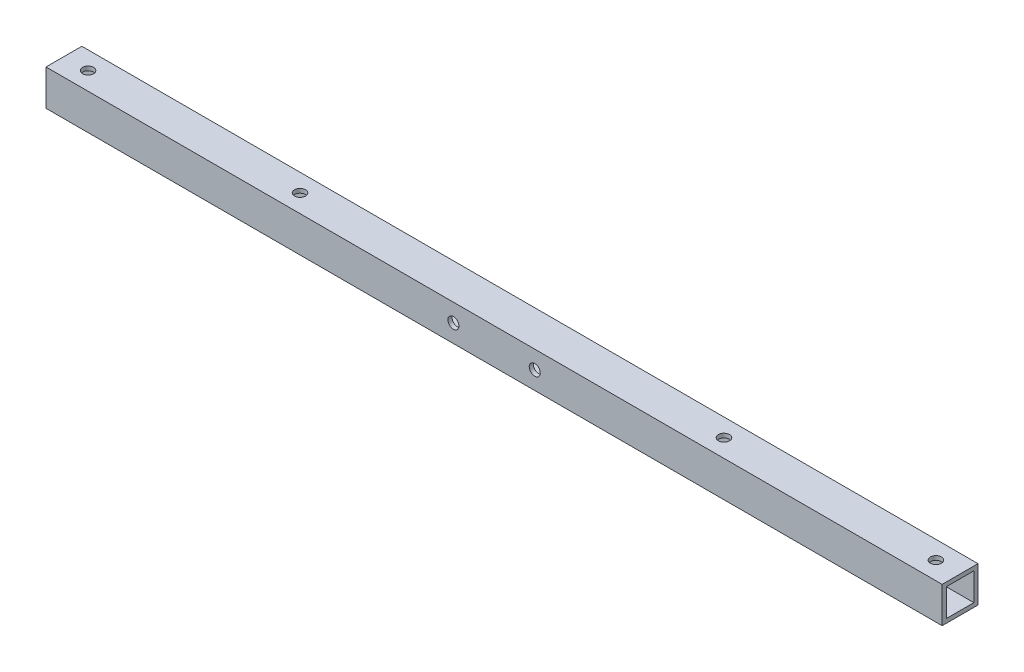
ISO-10303-21;
HEADER;
FILE_DESCRIPTION(('STEP AP214'),'2;1');
FILE_NAME('part.step','',(''),(''),'','','');
FILE_SCHEMA(('AUTOMOTIVE_DESIGN { 1 0 10303 214 1 1 1 1 }'));
ENDSEC;
DATA;
#1=APPLICATION_CONTEXT('core data for automotive mechanical design processes');
#2=APPLICATION_PROTOCOL_DEFINITION('international standard','automotive_design',2000,#1);
#3=PRODUCT_CONTEXT('',#1,'mechanical');
#4=PRODUCT('Part','Part','',(#3));
#5=PRODUCT_RELATED_PRODUCT_CATEGORY('part','',(#4));
#6=PRODUCT_DEFINITION_FORMATION('','',#4);
#7=PRODUCT_DEFINITION_CONTEXT('part definition',#1,'design');
#8=PRODUCT_DEFINITION('design','',#6,#7);
#9=PRODUCT_DEFINITION_SHAPE('','',#8);
#10=(LENGTH_UNIT() NAMED_UNIT(*) SI_UNIT(.MILLI.,.METRE.));
#11=(NAMED_UNIT(*) PLANE_ANGLE_UNIT() SI_UNIT($,.RADIAN.));
#12=(NAMED_UNIT(*) SI_UNIT($,.STERADIAN.) SOLID_ANGLE_UNIT());
#13=UNCERTAINTY_MEASURE_WITH_UNIT(LENGTH_MEASURE(1.E-05),#10,'distance_accuracy_value','');
#14=(GEOMETRIC_REPRESENTATION_CONTEXT(3) GLOBAL_UNCERTAINTY_ASSIGNED_CONTEXT((#13)) GLOBAL_UNIT_ASSIGNED_CONTEXT((#10,
#11,#12)) REPRESENTATION_CONTEXT('',''));
#15=CARTESIAN_POINT('',(0.,0.,0.));
#16=DIRECTION('',(0.,0.,1.));
#17=DIRECTION('',(1.,0.,0.));
#18=AXIS2_PLACEMENT_3D('',#15,#16,#17);
#19=CARTESIAN_POINT('',(325.,26.,-13.));
#20=DIRECTION('',(-1.,0.,0.));
#21=DIRECTION('',(0.,0.,1.));
#22=AXIS2_PLACEMENT_3D('',#19,#20,#21);
#23=PLANE('',#22);
#24=DIRECTION('',(0.,0.,-1.));
#25=VECTOR('',#24,1.);
#26=CARTESIAN_POINT('',(325.,0.,-13.));
#27=LINE('',#26,#25);
#28=CARTESIAN_POINT('',(325.,0.,13.));
#29=VERTEX_POINT('',#28);
#30=CARTESIAN_POINT('',(325.,0.,-13.));
#31=VERTEX_POINT('',#30);
#32=EDGE_CURVE('E148',#29,#31,#27,.T.);
#33=ORIENTED_EDGE('',*,*,#32,.T.);
#34=DIRECTION('',(0.,-1.,0.));
#35=VECTOR('',#34,1.);
#36=CARTESIAN_POINT('',(325.,26.,-13.));
#37=LINE('',#36,#35);
#38=CARTESIAN_POINT('',(325.,26.,-13.));
#39=VERTEX_POINT('',#38);
#40=EDGE_CURVE('E11',#39,#31,#37,.T.);
#41=ORIENTED_EDGE('',*,*,#40,.F.);
#42=DIRECTION('',(0.,0.,-1.));
#43=VECTOR('',#42,1.);
#44=CARTESIAN_POINT('',(325.,26.,-13.));
#45=LINE('',#44,#43);
#46=CARTESIAN_POINT('',(325.,26.,13.));
#47=VERTEX_POINT('',#46);
#48=EDGE_CURVE('E157',#47,#39,#45,.T.);
#49=ORIENTED_EDGE('',*,*,#48,.F.);
#50=DIRECTION('',(0.,-1.,0.));
#51=VECTOR('',#50,1.);
#52=CARTESIAN_POINT('',(325.,26.,13.));
#53=LINE('',#52,#51);
#54=EDGE_CURVE('E171',#47,#29,#53,.T.);
#55=ORIENTED_EDGE('',*,*,#54,.T.);
#56=EDGE_LOOP('',(#33,#41,#49,#55));
#57=FACE_BOUND('',#56,.T.);
#58=DIRECTION('',(0.,0.,-1.));
#59=VECTOR('',#58,1.);
#60=CARTESIAN_POINT('',(325.,3.,-13.));
#61=LINE('',#60,#59);
#62=CARTESIAN_POINT('',(325.,3.,10.));
#63=VERTEX_POINT('',#62);
#64=CARTESIAN_POINT('',(325.,3.,-10.));
#65=VERTEX_POINT('',#64);
#66=EDGE_CURVE('E116',#63,#65,#61,.T.);
#67=ORIENTED_EDGE('',*,*,#66,.F.);
#68=DIRECTION('',(0.,-1.,0.));
#69=VECTOR('',#68,1.);
#70=CARTESIAN_POINT('',(325.,26.,10.));
#71=LINE('',#70,#69);
#72=CARTESIAN_POINT('',(325.,23.,10.));
#73=VERTEX_POINT('',#72);
#74=EDGE_CURVE('E142',#73,#63,#71,.T.);
#75=ORIENTED_EDGE('',*,*,#74,.F.);
#76=DIRECTION('',(0.,0.,-1.));
#77=VECTOR('',#76,1.);
#78=CARTESIAN_POINT('',(325.,23.,-13.));
#79=LINE('',#78,#77);
#80=CARTESIAN_POINT('',(325.,23.,-10.));
#81=VERTEX_POINT('',#80);
#82=EDGE_CURVE('E60',#73,#81,#79,.T.);
#83=ORIENTED_EDGE('',*,*,#82,.T.);
#84=DIRECTION('',(0.,-1.,0.));
#85=VECTOR('',#84,1.);
#86=CARTESIAN_POINT('',(325.,26.,-10.));
#87=LINE('',#86,#85);
#88=EDGE_CURVE('E128',#81,#65,#87,.T.);
#89=ORIENTED_EDGE('',*,*,#88,.T.);
#90=EDGE_LOOP('',(#67,#75,#83,#89));
#91=FACE_BOUND('',#90,.T.);
#92=ADVANCED_FACE('F43',(#57,#91),#23,.F.);
#93=CARTESIAN_POINT('',(-325.,26.,-13.));
#94=DIRECTION('',(1.,0.,0.));
#95=DIRECTION('',(0.,0.,-1.));
#96=AXIS2_PLACEMENT_3D('',#93,#94,#95);
#97=PLANE('',#96);
#98=DIRECTION('',(0.,0.,1.));
#99=VECTOR('',#98,1.);
#100=CARTESIAN_POINT('',(-325.,0.,-13.));
#101=LINE('',#100,#99);
#102=CARTESIAN_POINT('',(-325.,0.,-13.));
#103=VERTEX_POINT('',#102);
#104=CARTESIAN_POINT('',(-325.,0.,13.));
#105=VERTEX_POINT('',#104);
#106=EDGE_CURVE('E178',#103,#105,#101,.T.);
#107=ORIENTED_EDGE('',*,*,#106,.T.);
#108=DIRECTION('',(0.,-1.,0.));
#109=VECTOR('',#108,1.);
#110=CARTESIAN_POINT('',(-325.,26.,13.));
#111=LINE('',#110,#109);
#112=CARTESIAN_POINT('',(-325.,26.,13.));
#113=VERTEX_POINT('',#112);
#114=EDGE_CURVE('E186',#113,#105,#111,.T.);
#115=ORIENTED_EDGE('',*,*,#114,.F.);
#116=DIRECTION('',(0.,0.,1.));
#117=VECTOR('',#116,1.);
#118=CARTESIAN_POINT('',(-325.,26.,-13.));
#119=LINE('',#118,#117);
#120=CARTESIAN_POINT('',(-325.,26.,-13.));
#121=VERTEX_POINT('',#120);
#122=EDGE_CURVE('E165',#121,#113,#119,.T.);
#123=ORIENTED_EDGE('',*,*,#122,.F.);
#124=DIRECTION('',(0.,-1.,0.));
#125=VECTOR('',#124,1.);
#126=CARTESIAN_POINT('',(-325.,26.,-13.));
#127=LINE('',#126,#125);
#128=EDGE_CURVE('E52',#121,#103,#127,.T.);
#129=ORIENTED_EDGE('',*,*,#128,.T.);
#130=EDGE_LOOP('',(#107,#115,#123,#129));
#131=FACE_BOUND('',#130,.T.);
#132=DIRECTION('',(0.,0.,1.));
#133=VECTOR('',#132,1.);
#134=CARTESIAN_POINT('',(-325.,3.,-13.));
#135=LINE('',#134,#133);
#136=CARTESIAN_POINT('',(-325.,3.,-10.));
#137=VERTEX_POINT('',#136);
#138=CARTESIAN_POINT('',(-325.,3.,10.));
#139=VERTEX_POINT('',#138);
#140=EDGE_CURVE('E113',#137,#139,#135,.T.);
#141=ORIENTED_EDGE('',*,*,#140,.F.);
#142=DIRECTION('',(0.,-1.,0.));
#143=VECTOR('',#142,1.);
#144=CARTESIAN_POINT('',(-325.,26.,-10.));
#145=LINE('',#144,#143);
#146=CARTESIAN_POINT('',(-325.,23.,-10.));
#147=VERTEX_POINT('',#146);
#148=EDGE_CURVE('E123',#147,#137,#145,.T.);
#149=ORIENTED_EDGE('',*,*,#148,.F.);
#150=DIRECTION('',(0.,0.,1.));
#151=VECTOR('',#150,1.);
#152=CARTESIAN_POINT('',(-325.,23.,-13.));
#153=LINE('',#152,#151);
#154=CARTESIAN_POINT('',(-325.,23.,10.));
#155=VERTEX_POINT('',#154);
#156=EDGE_CURVE('E65',#147,#155,#153,.T.);
#157=ORIENTED_EDGE('',*,*,#156,.T.);
#158=DIRECTION('',(0.,-1.,0.));
#159=VECTOR('',#158,1.);
#160=CARTESIAN_POINT('',(-325.,26.,10.));
#161=LINE('',#160,#159);
#162=EDGE_CURVE('E129',#155,#139,#161,.T.);
#163=ORIENTED_EDGE('',*,*,#162,.T.);
#164=EDGE_LOOP('',(#141,#149,#157,#163));
#165=FACE_BOUND('',#164,.T.);
#166=ADVANCED_FACE('F132',(#131,#165),#97,.F.);
#167=CARTESIAN_POINT('',(-325.,26.,-13.));
#168=DIRECTION('',(0.,0.,1.));
#169=DIRECTION('',(1.,0.,0.));
#170=AXIS2_PLACEMENT_3D('',#167,#168,#169);
#171=PLANE('',#170);
#172=CARTESIAN_POINT('',(-29.4999999999988,13.,-13.));
#173=DIRECTION('',(0.,0.,1.));
#174=DIRECTION('',(1.,0.,0.));
#175=AXIS2_PLACEMENT_3D('',#172,#173,#174);
#176=CIRCLE('',#175,4.);
#177=CARTESIAN_POINT('',(-25.4999999999988,13.,-13.));
#178=VERTEX_POINT('',#177);
#179=EDGE_CURVE('E215',#178,#178,#176,.T.);
#180=ORIENTED_EDGE('',*,*,#179,.T.);
#181=EDGE_LOOP('',(#180));
#182=FACE_BOUND('',#181,.T.);
#183=CARTESIAN_POINT('',(29.5000000000012,12.9999999999999,-13.));
#184=DIRECTION('',(0.,0.,1.));
#185=DIRECTION('',(1.,0.,0.));
#186=AXIS2_PLACEMENT_3D('',#183,#184,#185);
#187=CIRCLE('',#186,4.);
#188=CARTESIAN_POINT('',(33.5000000000012,12.9999999999999,-13.));
#189=VERTEX_POINT('',#188);
#190=EDGE_CURVE('E230',#189,#189,#187,.T.);
#191=ORIENTED_EDGE('',*,*,#190,.T.);
#192=EDGE_LOOP('',(#191));
#193=FACE_BOUND('',#192,.T.);
#194=DIRECTION('',(-1.,0.,0.));
#195=VECTOR('',#194,1.);
#196=CARTESIAN_POINT('',(-325.,0.,-13.));
#197=LINE('',#196,#195);
#198=EDGE_CURVE('E175',#31,#103,#197,.T.);
#199=ORIENTED_EDGE('',*,*,#198,.T.);
#200=ORIENTED_EDGE('',*,*,#128,.F.);
#201=DIRECTION('',(-1.,0.,0.));
#202=VECTOR('',#201,1.);
#203=CARTESIAN_POINT('',(-325.,26.,-13.));
#204=LINE('',#203,#202);
#205=EDGE_CURVE('E161',#39,#121,#204,.T.);
#206=ORIENTED_EDGE('',*,*,#205,.F.);
#207=ORIENTED_EDGE('',*,*,#40,.T.);
#208=EDGE_LOOP('',(#199,#200,#206,#207));
#209=FACE_BOUND('',#208,.T.);
#210=ADVANCED_FACE('F298',(#182,#193,#209),#171,.F.);
#211=CARTESIAN_POINT('',(-325.,26.,13.));
#212=DIRECTION('',(0.,0.,-1.));
#213=DIRECTION('',(-1.,0.,0.));
#214=AXIS2_PLACEMENT_3D('',#211,#212,#213);
#215=PLANE('',#214);
#216=CARTESIAN_POINT('',(-29.4999999999988,13.,13.));
#217=DIRECTION('',(0.,0.,1.));
#218=DIRECTION('',(1.,0.,0.));
#219=AXIS2_PLACEMENT_3D('',#216,#217,#218);
#220=CIRCLE('',#219,4.);
#221=CARTESIAN_POINT('',(-25.4999999999988,13.,13.));
#222=VERTEX_POINT('',#221);
#223=EDGE_CURVE('E223',#222,#222,#220,.T.);
#224=ORIENTED_EDGE('',*,*,#223,.F.);
#225=EDGE_LOOP('',(#224));
#226=FACE_BOUND('',#225,.T.);
#227=CARTESIAN_POINT('',(29.5000000000012,12.9999999999999,13.));
#228=DIRECTION('',(0.,0.,1.));
#229=DIRECTION('',(1.,0.,0.));
#230=AXIS2_PLACEMENT_3D('',#227,#228,#229);
#231=CIRCLE('',#230,4.);
#232=CARTESIAN_POINT('',(33.5000000000012,12.9999999999999,13.));
#233=VERTEX_POINT('',#232);
#234=EDGE_CURVE('E236',#233,#233,#231,.T.);
#235=ORIENTED_EDGE('',*,*,#234,.F.);
#236=EDGE_LOOP('',(#235));
#237=FACE_BOUND('',#236,.T.);
#238=DIRECTION('',(1.,0.,0.));
#239=VECTOR('',#238,1.);
#240=CARTESIAN_POINT('',(-325.,0.,13.));
#241=LINE('',#240,#239);
#242=EDGE_CURVE('E162',#105,#29,#241,.T.);
#243=ORIENTED_EDGE('',*,*,#242,.T.);
#244=ORIENTED_EDGE('',*,*,#54,.F.);
#245=DIRECTION('',(1.,0.,0.));
#246=VECTOR('',#245,1.);
#247=CARTESIAN_POINT('',(-325.,26.,13.));
#248=LINE('',#247,#246);
#249=EDGE_CURVE('E168',#113,#47,#248,.T.);
#250=ORIENTED_EDGE('',*,*,#249,.F.);
#251=ORIENTED_EDGE('',*,*,#114,.T.);
#252=EDGE_LOOP('',(#243,#244,#250,#251));
#253=FACE_BOUND('',#252,.T.);
#254=ADVANCED_FACE('F317',(#226,#237,#253),#215,.F.);
#255=CARTESIAN_POINT('',(0.,26.,0.));
#256=DIRECTION('',(0.,1.,0.));
#257=DIRECTION('',(0.,0.,1.));
#258=AXIS2_PLACEMENT_3D('',#255,#256,#257);
#259=PLANE('',#258);
#260=CARTESIAN_POINT('',(307.5,26.,0.));
#261=DIRECTION('',(0.,1.,0.));
#262=DIRECTION('',(0.,0.,1.));
#263=AXIS2_PLACEMENT_3D('',#260,#261,#262);
#264=CIRCLE('',#263,3.99999999999999);
#265=CARTESIAN_POINT('',(307.5,26.,3.99999999999999));
#266=VERTEX_POINT('',#265);
#267=EDGE_CURVE('E248',#266,#266,#264,.T.);
#268=ORIENTED_EDGE('',*,*,#267,.F.);
#269=EDGE_LOOP('',(#268));
#270=FACE_BOUND('',#269,.T.);
#271=CARTESIAN_POINT('',(-153.75,26.,0.));
#272=DIRECTION('',(0.,1.,0.));
#273=DIRECTION('',(0.,0.,-1.));
#274=AXIS2_PLACEMENT_3D('',#271,#272,#273);
#275=CIRCLE('',#274,3.99999999999999);
#276=CARTESIAN_POINT('',(-153.75,26.,-3.99999999999998));
#277=VERTEX_POINT('',#276);
#278=EDGE_CURVE('E244',#277,#277,#275,.T.);
#279=ORIENTED_EDGE('',*,*,#278,.F.);
#280=EDGE_LOOP('',(#279));
#281=FACE_BOUND('',#280,.T.);
#282=CARTESIAN_POINT('',(153.75,26.,0.));
#283=DIRECTION('',(0.,1.,0.));
#284=DIRECTION('',(0.,0.,1.));
#285=AXIS2_PLACEMENT_3D('',#282,#283,#284);
#286=CIRCLE('',#285,3.99999999999999);
#287=CARTESIAN_POINT('',(153.75,26.,3.99999999999999));
#288=VERTEX_POINT('',#287);
#289=EDGE_CURVE('E257',#288,#288,#286,.T.);
#290=ORIENTED_EDGE('',*,*,#289,.F.);
#291=EDGE_LOOP('',(#290));
#292=FACE_BOUND('',#291,.T.);
#293=CARTESIAN_POINT('',(-307.5,26.,0.));
#294=DIRECTION('',(0.,1.,0.));
#295=DIRECTION('',(0.,0.,-1.));
#296=AXIS2_PLACEMENT_3D('',#293,#294,#295);
#297=CIRCLE('',#296,3.99999999999999);
#298=CARTESIAN_POINT('',(-307.5,26.,-3.99999999999999));
#299=VERTEX_POINT('',#298);
#300=EDGE_CURVE('E264',#299,#299,#297,.T.);
#301=ORIENTED_EDGE('',*,*,#300,.F.);
#302=EDGE_LOOP('',(#301));
#303=FACE_BOUND('',#302,.T.);
#304=ORIENTED_EDGE('',*,*,#48,.T.);
#305=ORIENTED_EDGE('',*,*,#205,.T.);
#306=ORIENTED_EDGE('',*,*,#122,.T.);
#307=ORIENTED_EDGE('',*,*,#249,.T.);
#308=EDGE_LOOP('',(#304,#305,#306,#307));
#309=FACE_BOUND('',#308,.T.);
#310=ADVANCED_FACE('F313',(#270,#281,#292,#303,#309),#259,.T.);
#311=CARTESIAN_POINT('',(0.,0.,0.));
#312=DIRECTION('',(0.,1.,0.));
#313=DIRECTION('',(0.,0.,1.));
#314=AXIS2_PLACEMENT_3D('',#311,#312,#313);
#315=PLANE('',#314);
#316=CARTESIAN_POINT('',(307.5,0.,0.));
#317=DIRECTION('',(0.,1.,0.));
#318=DIRECTION('',(0.,0.,1.));
#319=AXIS2_PLACEMENT_3D('',#316,#317,#318);
#320=CIRCLE('',#319,3.99999999999999);
#321=CARTESIAN_POINT('',(307.5,0.,3.99999999999999));
#322=VERTEX_POINT('',#321);
#323=EDGE_CURVE('E198',#322,#322,#320,.T.);
#324=ORIENTED_EDGE('',*,*,#323,.T.);
#325=EDGE_LOOP('',(#324));
#326=FACE_BOUND('',#325,.T.);
#327=CARTESIAN_POINT('',(-153.75,0.,0.));
#328=DIRECTION('',(0.,1.,0.));
#329=DIRECTION('',(0.,0.,-1.));
#330=AXIS2_PLACEMENT_3D('',#327,#328,#329);
#331=CIRCLE('',#330,3.99999999999999);
#332=CARTESIAN_POINT('',(-153.75,0.,-3.99999999999998));
#333=VERTEX_POINT('',#332);
#334=EDGE_CURVE('E253',#333,#333,#331,.T.);
#335=ORIENTED_EDGE('',*,*,#334,.T.);
#336=EDGE_LOOP('',(#335));
#337=FACE_BOUND('',#336,.T.);
#338=CARTESIAN_POINT('',(153.75,0.,0.));
#339=DIRECTION('',(0.,1.,0.));
#340=DIRECTION('',(0.,0.,1.));
#341=AXIS2_PLACEMENT_3D('',#338,#339,#340);
#342=CIRCLE('',#341,3.99999999999999);
#343=CARTESIAN_POINT('',(153.75,0.,3.99999999999999));
#344=VERTEX_POINT('',#343);
#345=EDGE_CURVE('E268',#344,#344,#342,.T.);
#346=ORIENTED_EDGE('',*,*,#345,.T.);
#347=EDGE_LOOP('',(#346));
#348=FACE_BOUND('',#347,.T.);
#349=CARTESIAN_POINT('',(-307.5,0.,0.));
#350=DIRECTION('',(0.,1.,0.));
#351=DIRECTION('',(0.,0.,-1.));
#352=AXIS2_PLACEMENT_3D('',#349,#350,#351);
#353=CIRCLE('',#352,3.99999999999999);
#354=CARTESIAN_POINT('',(-307.5,0.,-3.99999999999999));
#355=VERTEX_POINT('',#354);
#356=EDGE_CURVE('E252',#355,#355,#353,.T.);
#357=ORIENTED_EDGE('',*,*,#356,.T.);
#358=EDGE_LOOP('',(#357));
#359=FACE_BOUND('',#358,.T.);
#360=ORIENTED_EDGE('',*,*,#32,.F.);
#361=ORIENTED_EDGE('',*,*,#242,.F.);
#362=ORIENTED_EDGE('',*,*,#106,.F.);
#363=ORIENTED_EDGE('',*,*,#198,.F.);
#364=EDGE_LOOP('',(#360,#361,#362,#363));
#365=FACE_BOUND('',#364,.T.);
#366=ADVANCED_FACE('F307',(#326,#337,#348,#359,#365),#315,.F.);
#367=CARTESIAN_POINT('',(-325.,26.,-10.));
#368=DIRECTION('',(0.,0.,1.));
#369=DIRECTION('',(1.,0.,0.));
#370=AXIS2_PLACEMENT_3D('',#367,#368,#369);
#371=PLANE('',#370);
#372=CARTESIAN_POINT('',(-29.4999999999988,13.,-10.));
#373=DIRECTION('',(0.,0.,1.));
#374=DIRECTION('',(1.,0.,0.));
#375=AXIS2_PLACEMENT_3D('',#372,#373,#374);
#376=CIRCLE('',#375,4.);
#377=CARTESIAN_POINT('',(-25.4999999999988,13.,-10.));
#378=VERTEX_POINT('',#377);
#379=EDGE_CURVE('E240',#378,#378,#376,.T.);
#380=ORIENTED_EDGE('',*,*,#379,.F.);
#381=EDGE_LOOP('',(#380));
#382=FACE_BOUND('',#381,.T.);
#383=CARTESIAN_POINT('',(29.5000000000012,12.9999999999999,-10.));
#384=DIRECTION('',(0.,0.,1.));
#385=DIRECTION('',(1.,0.,0.));
#386=AXIS2_PLACEMENT_3D('',#383,#384,#385);
#387=CIRCLE('',#386,4.);
#388=CARTESIAN_POINT('',(33.5000000000012,12.9999999999999,-10.));
#389=VERTEX_POINT('',#388);
#390=EDGE_CURVE('E214',#389,#389,#387,.T.);
#391=ORIENTED_EDGE('',*,*,#390,.F.);
#392=EDGE_LOOP('',(#391));
#393=FACE_BOUND('',#392,.T.);
#394=DIRECTION('',(-1.,0.,0.));
#395=VECTOR('',#394,1.);
#396=CARTESIAN_POINT('',(-325.,3.,-10.));
#397=LINE('',#396,#395);
#398=EDGE_CURVE('E109',#65,#137,#397,.T.);
#399=ORIENTED_EDGE('',*,*,#398,.F.);
#400=ORIENTED_EDGE('',*,*,#88,.F.);
#401=DIRECTION('',(-1.,0.,0.));
#402=VECTOR('',#401,1.);
#403=CARTESIAN_POINT('',(-325.,23.,-10.));
#404=LINE('',#403,#402);
#405=EDGE_CURVE('E125',#81,#147,#404,.T.);
#406=ORIENTED_EDGE('',*,*,#405,.T.);
#407=ORIENTED_EDGE('',*,*,#148,.T.);
#408=EDGE_LOOP('',(#399,#400,#406,#407));
#409=FACE_BOUND('',#408,.T.);
#410=ADVANCED_FACE('F124',(#382,#393,#409),#371,.T.);
#411=CARTESIAN_POINT('',(-325.,26.,10.));
#412=DIRECTION('',(0.,0.,-1.));
#413=DIRECTION('',(-1.,0.,0.));
#414=AXIS2_PLACEMENT_3D('',#411,#412,#413);
#415=PLANE('',#414);
#416=CARTESIAN_POINT('',(-29.4999999999988,13.,9.99999999999999));
#417=DIRECTION('',(0.,0.,-1.));
#418=DIRECTION('',(-1.,0.,0.));
#419=AXIS2_PLACEMENT_3D('',#416,#417,#418);
#420=CIRCLE('',#419,4.);
#421=CARTESIAN_POINT('',(-33.4999999999988,13.,9.99999999999999));
#422=VERTEX_POINT('',#421);
#423=EDGE_CURVE('E46',#422,#422,#420,.T.);
#424=ORIENTED_EDGE('',*,*,#423,.F.);
#425=EDGE_LOOP('',(#424));
#426=FACE_BOUND('',#425,.T.);
#427=CARTESIAN_POINT('',(29.5000000000012,12.9999999999999,9.99999999999999));
#428=DIRECTION('',(0.,0.,-1.));
#429=DIRECTION('',(-1.,0.,0.));
#430=AXIS2_PLACEMENT_3D('',#427,#428,#429);
#431=CIRCLE('',#430,4.);
#432=CARTESIAN_POINT('',(25.5000000000012,12.9999999999999,9.99999999999999));
#433=VERTEX_POINT('',#432);
#434=EDGE_CURVE('E212',#433,#433,#431,.T.);
#435=ORIENTED_EDGE('',*,*,#434,.F.);
#436=EDGE_LOOP('',(#435));
#437=FACE_BOUND('',#436,.T.);
#438=DIRECTION('',(1.,0.,0.));
#439=VECTOR('',#438,1.);
#440=CARTESIAN_POINT('',(-325.,3.,10.));
#441=LINE('',#440,#439);
#442=EDGE_CURVE('E134',#139,#63,#441,.T.);
#443=ORIENTED_EDGE('',*,*,#442,.F.);
#444=ORIENTED_EDGE('',*,*,#162,.F.);
#445=DIRECTION('',(1.,0.,0.));
#446=VECTOR('',#445,1.);
#447=CARTESIAN_POINT('',(-325.,23.,10.));
#448=LINE('',#447,#446);
#449=EDGE_CURVE('E145',#155,#73,#448,.T.);
#450=ORIENTED_EDGE('',*,*,#449,.T.);
#451=ORIENTED_EDGE('',*,*,#74,.T.);
#452=EDGE_LOOP('',(#443,#444,#450,#451));
#453=FACE_BOUND('',#452,.T.);
#454=ADVANCED_FACE('F291',(#426,#437,#453),#415,.T.);
#455=CARTESIAN_POINT('',(0.,23.,0.));
#456=DIRECTION('',(0.,1.,0.));
#457=DIRECTION('',(0.,0.,1.));
#458=AXIS2_PLACEMENT_3D('',#455,#456,#457);
#459=PLANE('',#458);
#460=CARTESIAN_POINT('',(307.5,23.,0.));
#461=DIRECTION('',(0.,1.,0.));
#462=DIRECTION('',(0.,0.,1.));
#463=AXIS2_PLACEMENT_3D('',#460,#461,#462);
#464=CIRCLE('',#463,3.99999999999999);
#465=CARTESIAN_POINT('',(307.5,23.,3.99999999999999));
#466=VERTEX_POINT('',#465);
#467=EDGE_CURVE('E156',#466,#466,#464,.T.);
#468=ORIENTED_EDGE('',*,*,#467,.T.);
#469=EDGE_LOOP('',(#468));
#470=FACE_BOUND('',#469,.T.);
#471=CARTESIAN_POINT('',(-153.75,23.,0.));
#472=DIRECTION('',(0.,1.,0.));
#473=DIRECTION('',(0.,0.,1.));
#474=AXIS2_PLACEMENT_3D('',#471,#472,#473);
#475=CIRCLE('',#474,3.99999999999999);
#476=CARTESIAN_POINT('',(-153.75,23.,4.));
#477=VERTEX_POINT('',#476);
#478=EDGE_CURVE('E208',#477,#477,#475,.T.);
#479=ORIENTED_EDGE('',*,*,#478,.T.);
#480=EDGE_LOOP('',(#479));
#481=FACE_BOUND('',#480,.T.);
#482=CARTESIAN_POINT('',(153.75,23.,0.));
#483=DIRECTION('',(0.,1.,0.));
#484=DIRECTION('',(0.,0.,1.));
#485=AXIS2_PLACEMENT_3D('',#482,#483,#484);
#486=CIRCLE('',#485,3.99999999999999);
#487=CARTESIAN_POINT('',(153.75,23.,3.99999999999999));
#488=VERTEX_POINT('',#487);
#489=EDGE_CURVE('E203',#488,#488,#486,.T.);
#490=ORIENTED_EDGE('',*,*,#489,.T.);
#491=EDGE_LOOP('',(#490));
#492=FACE_BOUND('',#491,.T.);
#493=CARTESIAN_POINT('',(-307.5,23.,0.));
#494=DIRECTION('',(0.,1.,0.));
#495=DIRECTION('',(0.,0.,1.));
#496=AXIS2_PLACEMENT_3D('',#493,#494,#495);
#497=CIRCLE('',#496,3.99999999999999);
#498=CARTESIAN_POINT('',(-307.5,23.,4.));
#499=VERTEX_POINT('',#498);
#500=EDGE_CURVE('E197',#499,#499,#497,.T.);
#501=ORIENTED_EDGE('',*,*,#500,.T.);
#502=EDGE_LOOP('',(#501));
#503=FACE_BOUND('',#502,.T.);
#504=ORIENTED_EDGE('',*,*,#82,.F.);
#505=ORIENTED_EDGE('',*,*,#449,.F.);
#506=ORIENTED_EDGE('',*,*,#156,.F.);
#507=ORIENTED_EDGE('',*,*,#405,.F.);
#508=EDGE_LOOP('',(#504,#505,#506,#507));
#509=FACE_BOUND('',#508,.T.);
#510=ADVANCED_FACE('F336',(#470,#481,#492,#503,#509),#459,.F.);
#511=CARTESIAN_POINT('',(0.,3.,0.));
#512=DIRECTION('',(0.,1.,0.));
#513=DIRECTION('',(0.,0.,1.));
#514=AXIS2_PLACEMENT_3D('',#511,#512,#513);
#515=PLANE('',#514);
#516=CARTESIAN_POINT('',(307.5,3.,0.));
#517=DIRECTION('',(0.,1.,0.));
#518=DIRECTION('',(0.,0.,1.));
#519=AXIS2_PLACEMENT_3D('',#516,#517,#518);
#520=CIRCLE('',#519,3.99999999999999);
#521=CARTESIAN_POINT('',(307.5,3.,3.99999999999999));
#522=VERTEX_POINT('',#521);
#523=EDGE_CURVE('E209',#522,#522,#520,.T.);
#524=ORIENTED_EDGE('',*,*,#523,.F.);
#525=EDGE_LOOP('',(#524));
#526=FACE_BOUND('',#525,.T.);
#527=CARTESIAN_POINT('',(-153.75,3.,0.));
#528=DIRECTION('',(0.,1.,0.));
#529=DIRECTION('',(0.,0.,1.));
#530=AXIS2_PLACEMENT_3D('',#527,#528,#529);
#531=CIRCLE('',#530,3.99999999999999);
#532=CARTESIAN_POINT('',(-153.75,3.,4.));
#533=VERTEX_POINT('',#532);
#534=EDGE_CURVE('E204',#533,#533,#531,.T.);
#535=ORIENTED_EDGE('',*,*,#534,.F.);
#536=EDGE_LOOP('',(#535));
#537=FACE_BOUND('',#536,.T.);
#538=CARTESIAN_POINT('',(153.75,3.,0.));
#539=DIRECTION('',(0.,1.,0.));
#540=DIRECTION('',(0.,0.,1.));
#541=AXIS2_PLACEMENT_3D('',#538,#539,#540);
#542=CIRCLE('',#541,3.99999999999999);
#543=CARTESIAN_POINT('',(153.75,3.,3.99999999999999));
#544=VERTEX_POINT('',#543);
#545=EDGE_CURVE('E199',#544,#544,#542,.T.);
#546=ORIENTED_EDGE('',*,*,#545,.F.);
#547=EDGE_LOOP('',(#546));
#548=FACE_BOUND('',#547,.T.);
#549=CARTESIAN_POINT('',(-307.5,3.,0.));
#550=DIRECTION('',(0.,1.,0.));
#551=DIRECTION('',(0.,0.,1.));
#552=AXIS2_PLACEMENT_3D('',#549,#550,#551);
#553=CIRCLE('',#552,3.99999999999999);
#554=CARTESIAN_POINT('',(-307.5,3.,4.));
#555=VERTEX_POINT('',#554);
#556=EDGE_CURVE('E193',#555,#555,#553,.T.);
#557=ORIENTED_EDGE('',*,*,#556,.F.);
#558=EDGE_LOOP('',(#557));
#559=FACE_BOUND('',#558,.T.);
#560=ORIENTED_EDGE('',*,*,#66,.T.);
#561=ORIENTED_EDGE('',*,*,#398,.T.);
#562=ORIENTED_EDGE('',*,*,#140,.T.);
#563=ORIENTED_EDGE('',*,*,#442,.T.);
#564=EDGE_LOOP('',(#560,#561,#562,#563));
#565=FACE_BOUND('',#564,.T.);
#566=ADVANCED_FACE('F111',(#526,#537,#548,#559,#565),#515,.T.);
#567=CARTESIAN_POINT('',(-307.5,0.,0.));
#568=DIRECTION('',(0.,1.,0.));
#569=DIRECTION('',(0.,0.,1.));
#570=AXIS2_PLACEMENT_3D('',#567,#568,#569);
#571=CYLINDRICAL_SURFACE('',#570,3.99999999999999);
#572=ORIENTED_EDGE('',*,*,#556,.T.);
#573=EDGE_LOOP('',(#572));
#574=FACE_BOUND('',#573,.T.);
#575=ORIENTED_EDGE('',*,*,#356,.F.);
#576=EDGE_LOOP('',(#575));
#577=FACE_BOUND('',#576,.T.);
#578=ADVANCED_FACE('F335',(#574,#577),#571,.F.);
#579=CARTESIAN_POINT('',(153.75,0.,0.));
#580=DIRECTION('',(0.,1.,0.));
#581=DIRECTION('',(0.,0.,1.));
#582=AXIS2_PLACEMENT_3D('',#579,#580,#581);
#583=CYLINDRICAL_SURFACE('',#582,3.99999999999999);
#584=ORIENTED_EDGE('',*,*,#545,.T.);
#585=EDGE_LOOP('',(#584));
#586=FACE_BOUND('',#585,.T.);
#587=ORIENTED_EDGE('',*,*,#345,.F.);
#588=EDGE_LOOP('',(#587));
#589=FACE_BOUND('',#588,.T.);
#590=ADVANCED_FACE('F347',(#586,#589),#583,.F.);
#591=CARTESIAN_POINT('',(-153.75,0.,0.));
#592=DIRECTION('',(0.,1.,0.));
#593=DIRECTION('',(0.,0.,1.));
#594=AXIS2_PLACEMENT_3D('',#591,#592,#593);
#595=CYLINDRICAL_SURFACE('',#594,3.99999999999999);
#596=ORIENTED_EDGE('',*,*,#534,.T.);
#597=EDGE_LOOP('',(#596));
#598=FACE_BOUND('',#597,.T.);
#599=ORIENTED_EDGE('',*,*,#334,.F.);
#600=EDGE_LOOP('',(#599));
#601=FACE_BOUND('',#600,.T.);
#602=ADVANCED_FACE('F350',(#598,#601),#595,.F.);
#603=CARTESIAN_POINT('',(307.5,0.,0.));
#604=DIRECTION('',(0.,1.,0.));
#605=DIRECTION('',(0.,0.,1.));
#606=AXIS2_PLACEMENT_3D('',#603,#604,#605);
#607=CYLINDRICAL_SURFACE('',#606,3.99999999999999);
#608=ORIENTED_EDGE('',*,*,#523,.T.);
#609=EDGE_LOOP('',(#608));
#610=FACE_BOUND('',#609,.T.);
#611=ORIENTED_EDGE('',*,*,#323,.F.);
#612=EDGE_LOOP('',(#611));
#613=FACE_BOUND('',#612,.T.);
#614=ADVANCED_FACE('F359',(#610,#613),#607,.F.);
#615=ORIENTED_EDGE('',*,*,#300,.T.);
#616=EDGE_LOOP('',(#615));
#617=FACE_BOUND('',#616,.T.);
#618=ORIENTED_EDGE('',*,*,#500,.F.);
#619=EDGE_LOOP('',(#618));
#620=FACE_BOUND('',#619,.T.);
#621=ADVANCED_FACE('F356',(#617,#620),#571,.F.);
#622=ORIENTED_EDGE('',*,*,#289,.T.);
#623=EDGE_LOOP('',(#622));
#624=FACE_BOUND('',#623,.T.);
#625=ORIENTED_EDGE('',*,*,#489,.F.);
#626=EDGE_LOOP('',(#625));
#627=FACE_BOUND('',#626,.T.);
#628=ADVANCED_FACE('F352',(#624,#627),#583,.F.);
#629=ORIENTED_EDGE('',*,*,#278,.T.);
#630=EDGE_LOOP('',(#629));
#631=FACE_BOUND('',#630,.T.);
#632=ORIENTED_EDGE('',*,*,#478,.F.);
#633=EDGE_LOOP('',(#632));
#634=FACE_BOUND('',#633,.T.);
#635=ADVANCED_FACE('F361',(#631,#634),#595,.F.);
#636=ORIENTED_EDGE('',*,*,#267,.T.);
#637=EDGE_LOOP('',(#636));
#638=FACE_BOUND('',#637,.T.);
#639=ORIENTED_EDGE('',*,*,#467,.F.);
#640=EDGE_LOOP('',(#639));
#641=FACE_BOUND('',#640,.T.);
#642=ADVANCED_FACE('F365',(#638,#641),#607,.F.);
#643=CARTESIAN_POINT('',(29.5000000000012,12.9999999999999,-13.));
#644=DIRECTION('',(0.,0.,1.));
#645=DIRECTION('',(1.,0.,0.));
#646=AXIS2_PLACEMENT_3D('',#643,#644,#645);
#647=CYLINDRICAL_SURFACE('',#646,4.);
#648=ORIENTED_EDGE('',*,*,#434,.T.);
#649=EDGE_LOOP('',(#648));
#650=FACE_BOUND('',#649,.T.);
#651=ORIENTED_EDGE('',*,*,#234,.T.);
#652=EDGE_LOOP('',(#651));
#653=FACE_BOUND('',#652,.T.);
#654=ADVANCED_FACE('F366',(#650,#653),#647,.F.);
#655=CARTESIAN_POINT('',(-29.4999999999988,13.,-13.));
#656=DIRECTION('',(0.,0.,1.));
#657=DIRECTION('',(1.,0.,0.));
#658=AXIS2_PLACEMENT_3D('',#655,#656,#657);
#659=CYLINDRICAL_SURFACE('',#658,4.);
#660=ORIENTED_EDGE('',*,*,#423,.T.);
#661=EDGE_LOOP('',(#660));
#662=FACE_BOUND('',#661,.T.);
#663=ORIENTED_EDGE('',*,*,#223,.T.);
#664=EDGE_LOOP('',(#663));
#665=FACE_BOUND('',#664,.T.);
#666=ADVANCED_FACE('F369',(#662,#665),#659,.F.);
#667=ORIENTED_EDGE('',*,*,#390,.T.);
#668=EDGE_LOOP('',(#667));
#669=FACE_BOUND('',#668,.T.);
#670=ORIENTED_EDGE('',*,*,#190,.F.);
#671=EDGE_LOOP('',(#670));
#672=FACE_BOUND('',#671,.T.);
#673=ADVANCED_FACE('F370',(#669,#672),#647,.F.);
#674=ORIENTED_EDGE('',*,*,#379,.T.);
#675=EDGE_LOOP('',(#674));
#676=FACE_BOUND('',#675,.T.);
#677=ORIENTED_EDGE('',*,*,#179,.F.);
#678=EDGE_LOOP('',(#677));
#679=FACE_BOUND('',#678,.T.);
#680=ADVANCED_FACE('F373',(#676,#679),#659,.F.);
#681=CLOSED_SHELL('',(#92,#166,#210,#254,#310,#366,#410,#454,#510,#566,#578,#590,#602,#614,#621,
#628,#635,#642,#654,#666,#673,#680));
#682=MANIFOLD_SOLID_BREP('B2',#681);
#683=ADVANCED_BREP_SHAPE_REPRESENTATION('',(#18,#682),#14);
#684=SHAPE_DEFINITION_REPRESENTATION(#9,#683);
ENDSEC;
END-ISO-10303-21;
